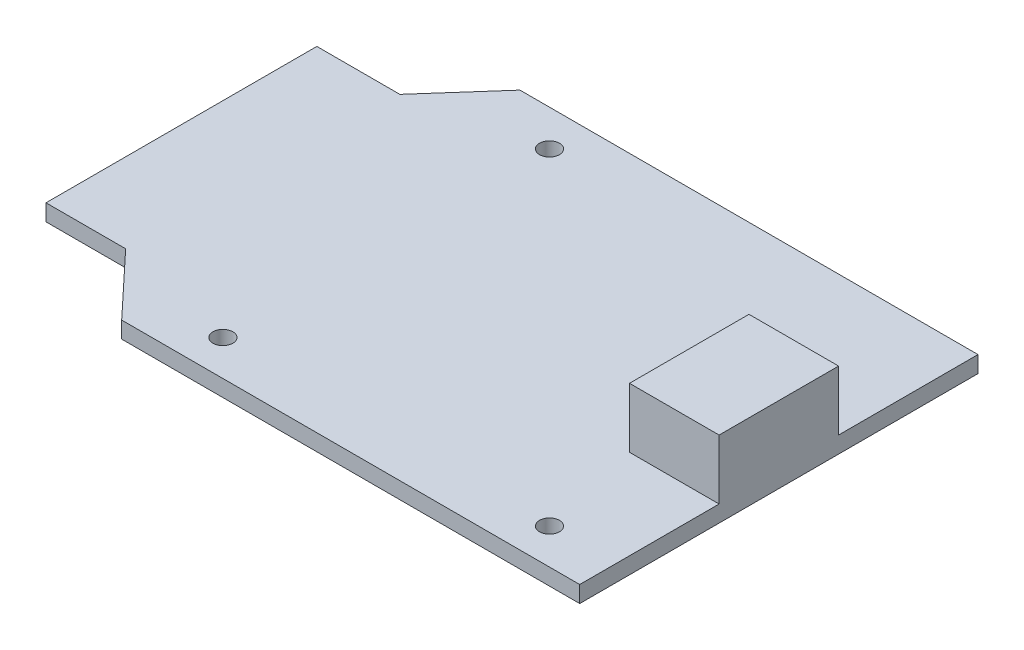
ISO-10303-21;
HEADER;
FILE_DESCRIPTION(('STEP AP214'),'2;1');
FILE_NAME('part.step','',(''),(''),'','','');
FILE_SCHEMA(('AUTOMOTIVE_DESIGN { 1 0 10303 214 1 1 1 1 }'));
ENDSEC;
DATA;
#1=APPLICATION_CONTEXT('core data for automotive mechanical design processes');
#2=APPLICATION_PROTOCOL_DEFINITION('international standard','automotive_design',2000,#1);
#3=PRODUCT_CONTEXT('',#1,'mechanical');
#4=PRODUCT('Part','Part','',(#3));
#5=PRODUCT_RELATED_PRODUCT_CATEGORY('part','',(#4));
#6=PRODUCT_DEFINITION_FORMATION('','',#4);
#7=PRODUCT_DEFINITION_CONTEXT('part definition',#1,'design');
#8=PRODUCT_DEFINITION('design','',#6,#7);
#9=PRODUCT_DEFINITION_SHAPE('','',#8);
#10=(LENGTH_UNIT() NAMED_UNIT(*) SI_UNIT(.MILLI.,.METRE.));
#11=(NAMED_UNIT(*) PLANE_ANGLE_UNIT() SI_UNIT($,.RADIAN.));
#12=(NAMED_UNIT(*) SI_UNIT($,.STERADIAN.) SOLID_ANGLE_UNIT());
#13=UNCERTAINTY_MEASURE_WITH_UNIT(LENGTH_MEASURE(1.E-05),#10,'distance_accuracy_value','');
#14=(GEOMETRIC_REPRESENTATION_CONTEXT(3) GLOBAL_UNCERTAINTY_ASSIGNED_CONTEXT((#13)) GLOBAL_UNIT_ASSIGNED_CONTEXT((#10,
#11,#12)) REPRESENTATION_CONTEXT('',''));
#15=CARTESIAN_POINT('',(0.,0.,0.));
#16=DIRECTION('',(0.,0.,1.));
#17=DIRECTION('',(1.,0.,0.));
#18=AXIS2_PLACEMENT_3D('',#15,#16,#17);
#19=CARTESIAN_POINT('',(0.,0.83,0.));
#20=DIRECTION('',(0.,-1.,0.));
#21=DIRECTION('',(0.,0.,-1.));
#22=AXIS2_PLACEMENT_3D('',#19,#20,#21);
#23=PLANE('',#22);
#24=CARTESIAN_POINT('',(19.7,0.83,18.2172922770292));
#25=DIRECTION('',(0.,1.,0.));
#26=DIRECTION('',(0.,0.,1.));
#27=AXIS2_PLACEMENT_3D('',#24,#25,#26);
#28=CIRCLE('',#27,0.499999999999999);
#29=CARTESIAN_POINT('',(19.7,0.83,18.7172922770292));
#30=VERTEX_POINT('',#29);
#31=EDGE_CURVE('E151',#30,#30,#28,.T.);
#32=ORIENTED_EDGE('',*,*,#31,.F.);
#33=EDGE_LOOP('',(#32));
#34=FACE_BOUND('',#33,.T.);
#35=CARTESIAN_POINT('',(3.3,0.83,18.2172922770292));
#36=DIRECTION('',(0.,1.,0.));
#37=DIRECTION('',(0.,0.,1.));
#38=AXIS2_PLACEMENT_3D('',#35,#36,#37);
#39=CIRCLE('',#38,0.499999999999999);
#40=CARTESIAN_POINT('',(3.3,0.83,18.7172922770292));
#41=VERTEX_POINT('',#40);
#42=EDGE_CURVE('E179',#41,#41,#39,.T.);
#43=ORIENTED_EDGE('',*,*,#42,.F.);
#44=EDGE_LOOP('',(#43));
#45=FACE_BOUND('',#44,.T.);
#46=CARTESIAN_POINT('',(3.3,0.83,1.81729227702918));
#47=DIRECTION('',(0.,1.,0.));
#48=DIRECTION('',(0.,0.,1.));
#49=AXIS2_PLACEMENT_3D('',#46,#47,#48);
#50=CIRCLE('',#49,0.499999999999999);
#51=CARTESIAN_POINT('',(3.3,0.83,2.31729227702917));
#52=VERTEX_POINT('',#51);
#53=EDGE_CURVE('E173',#52,#52,#50,.T.);
#54=ORIENTED_EDGE('',*,*,#53,.F.);
#55=EDGE_LOOP('',(#54));
#56=FACE_BOUND('',#55,.T.);
#57=DIRECTION('',(1.,0.,0.));
#58=VECTOR('',#57,1.);
#59=CARTESIAN_POINT('',(23.,0.83,13.));
#60=LINE('',#59,#58);
#61=CARTESIAN_POINT('',(18.5,0.83,13.));
#62=VERTEX_POINT('',#61);
#63=CARTESIAN_POINT('',(23.,0.83,13.));
#64=VERTEX_POINT('',#63);
#65=EDGE_CURVE('E52',#62,#64,#60,.T.);
#66=ORIENTED_EDGE('',*,*,#65,.F.);
#67=DIRECTION('',(0.,0.,1.));
#68=VECTOR('',#67,1.);
#69=CARTESIAN_POINT('',(18.5,0.83,7.));
#70=LINE('',#69,#68);
#71=CARTESIAN_POINT('',(18.5,0.83,7.));
#72=VERTEX_POINT('',#71);
#73=EDGE_CURVE('E162',#72,#62,#70,.T.);
#74=ORIENTED_EDGE('',*,*,#73,.F.);
#75=DIRECTION('',(-1.,0.,0.));
#76=VECTOR('',#75,1.);
#77=CARTESIAN_POINT('',(23.,0.83,7.));
#78=LINE('',#77,#76);
#79=CARTESIAN_POINT('',(23.,0.83,7.));
#80=VERTEX_POINT('',#79);
#81=EDGE_CURVE('E58',#80,#72,#78,.T.);
#82=ORIENTED_EDGE('',*,*,#81,.F.);
#83=DIRECTION('',(0.,0.,-1.));
#84=VECTOR('',#83,1.);
#85=CARTESIAN_POINT('',(23.,0.83,0.));
#86=LINE('',#85,#84);
#87=CARTESIAN_POINT('',(23.,0.83,0.));
#88=VERTEX_POINT('',#87);
#89=EDGE_CURVE('E147',#80,#88,#86,.T.);
#90=ORIENTED_EDGE('',*,*,#89,.T.);
#91=DIRECTION('',(-1.,0.,0.));
#92=VECTOR('',#91,1.);
#93=CARTESIAN_POINT('',(0.,0.83,0.));
#94=LINE('',#93,#92);
#95=CARTESIAN_POINT('',(0.,0.83,0.));
#96=VERTEX_POINT('',#95);
#97=EDGE_CURVE('E185',#88,#96,#94,.T.);
#98=ORIENTED_EDGE('',*,*,#97,.T.);
#99=DIRECTION('',(-0.662472858366407,0.,0.749085917587457));
#100=VECTOR('',#99,1.);
#101=CARTESIAN_POINT('',(0.,0.83,0.));
#102=LINE('',#101,#100);
#103=CARTESIAN_POINT('',(-2.83,0.83,3.2));
#104=VERTEX_POINT('',#103);
#105=EDGE_CURVE('E188',#96,#104,#102,.T.);
#106=ORIENTED_EDGE('',*,*,#105,.T.);
#107=DIRECTION('',(-1.,0.,0.));
#108=VECTOR('',#107,1.);
#109=CARTESIAN_POINT('',(-7.,0.83,3.2));
#110=LINE('',#109,#108);
#111=CARTESIAN_POINT('',(-7.,0.83,3.2));
#112=VERTEX_POINT('',#111);
#113=EDGE_CURVE('E191',#104,#112,#110,.T.);
#114=ORIENTED_EDGE('',*,*,#113,.T.);
#115=DIRECTION('',(0.,0.,1.));
#116=VECTOR('',#115,1.);
#117=CARTESIAN_POINT('',(-7.,0.83,3.2));
#118=LINE('',#117,#116);
#119=CARTESIAN_POINT('',(-7.,0.83,16.8));
#120=VERTEX_POINT('',#119);
#121=EDGE_CURVE('E193',#112,#120,#118,.T.);
#122=ORIENTED_EDGE('',*,*,#121,.T.);
#123=DIRECTION('',(1.,0.,0.));
#124=VECTOR('',#123,1.);
#125=CARTESIAN_POINT('',(-7.,0.83,16.8));
#126=LINE('',#125,#124);
#127=CARTESIAN_POINT('',(-3.00000000000001,0.83,16.8));
#128=VERTEX_POINT('',#127);
#129=EDGE_CURVE('E195',#120,#128,#126,.T.);
#130=ORIENTED_EDGE('',*,*,#129,.T.);
#131=DIRECTION('',(0.68394112888133,0.,0.729537204140085));
#132=VECTOR('',#131,1.);
#133=CARTESIAN_POINT('',(0.,0.83,20.));
#134=LINE('',#133,#132);
#135=CARTESIAN_POINT('',(0.,0.83,20.));
#136=VERTEX_POINT('',#135);
#137=EDGE_CURVE('E197',#128,#136,#134,.T.);
#138=ORIENTED_EDGE('',*,*,#137,.T.);
#139=DIRECTION('',(1.,0.,0.));
#140=VECTOR('',#139,1.);
#141=CARTESIAN_POINT('',(0.,0.83,20.));
#142=LINE('',#141,#140);
#143=CARTESIAN_POINT('',(23.,0.83,20.));
#144=VERTEX_POINT('',#143);
#145=EDGE_CURVE('E199',#136,#144,#142,.T.);
#146=ORIENTED_EDGE('',*,*,#145,.T.);
#147=EDGE_CURVE('E207',#144,#64,#86,.T.);
#148=ORIENTED_EDGE('',*,*,#147,.T.);
#149=EDGE_LOOP('',(#66,#74,#82,#90,#98,#106,#114,#122,#130,#138,#146,#148));
#150=FACE_BOUND('',#149,.T.);
#151=ADVANCED_FACE('F35',(#34,#45,#56,#150),#23,.F.);
#152=CARTESIAN_POINT('',(0.,0.,0.));
#153=DIRECTION('',(0.,-1.,0.));
#154=DIRECTION('',(0.,0.,-1.));
#155=AXIS2_PLACEMENT_3D('',#152,#153,#154);
#156=PLANE('',#155);
#157=CARTESIAN_POINT('',(3.3,0.,1.81729227702918));
#158=DIRECTION('',(0.,1.,0.));
#159=DIRECTION('',(0.,0.,1.));
#160=AXIS2_PLACEMENT_3D('',#157,#158,#159);
#161=CIRCLE('',#160,0.499999999999999);
#162=CARTESIAN_POINT('',(3.3,0.,2.31729227702917));
#163=VERTEX_POINT('',#162);
#164=EDGE_CURVE('E171',#163,#163,#161,.T.);
#165=ORIENTED_EDGE('',*,*,#164,.T.);
#166=EDGE_LOOP('',(#165));
#167=FACE_BOUND('',#166,.T.);
#168=DIRECTION('',(-1.,0.,0.));
#169=VECTOR('',#168,1.);
#170=CARTESIAN_POINT('',(0.,0.,0.));
#171=LINE('',#170,#169);
#172=CARTESIAN_POINT('',(23.,0.,0.));
#173=VERTEX_POINT('',#172);
#174=CARTESIAN_POINT('',(0.,0.,0.));
#175=VERTEX_POINT('',#174);
#176=EDGE_CURVE('E182',#173,#175,#171,.T.);
#177=ORIENTED_EDGE('',*,*,#176,.F.);
#178=DIRECTION('',(0.,0.,-1.));
#179=VECTOR('',#178,1.);
#180=CARTESIAN_POINT('',(23.,0.,0.));
#181=LINE('',#180,#179);
#182=CARTESIAN_POINT('',(23.,0.,20.));
#183=VERTEX_POINT('',#182);
#184=EDGE_CURVE('E189',#183,#173,#181,.T.);
#185=ORIENTED_EDGE('',*,*,#184,.F.);
#186=DIRECTION('',(1.,0.,0.));
#187=VECTOR('',#186,1.);
#188=CARTESIAN_POINT('',(0.,0.,20.));
#189=LINE('',#188,#187);
#190=CARTESIAN_POINT('',(0.,0.,20.));
#191=VERTEX_POINT('',#190);
#192=EDGE_CURVE('E230',#191,#183,#189,.T.);
#193=ORIENTED_EDGE('',*,*,#192,.F.);
#194=DIRECTION('',(0.68394112888133,0.,0.729537204140085));
#195=VECTOR('',#194,1.);
#196=CARTESIAN_POINT('',(0.,0.,20.));
#197=LINE('',#196,#195);
#198=CARTESIAN_POINT('',(-3.00000000000001,0.,16.8));
#199=VERTEX_POINT('',#198);
#200=EDGE_CURVE('E232',#199,#191,#197,.T.);
#201=ORIENTED_EDGE('',*,*,#200,.F.);
#202=DIRECTION('',(1.,0.,0.));
#203=VECTOR('',#202,1.);
#204=CARTESIAN_POINT('',(-7.,0.,16.8));
#205=LINE('',#204,#203);
#206=CARTESIAN_POINT('',(-7.,0.,16.8));
#207=VERTEX_POINT('',#206);
#208=EDGE_CURVE('E234',#207,#199,#205,.T.);
#209=ORIENTED_EDGE('',*,*,#208,.F.);
#210=DIRECTION('',(0.,0.,1.));
#211=VECTOR('',#210,1.);
#212=CARTESIAN_POINT('',(-7.,0.,3.2));
#213=LINE('',#212,#211);
#214=CARTESIAN_POINT('',(-7.,0.,3.2));
#215=VERTEX_POINT('',#214);
#216=EDGE_CURVE('E236',#215,#207,#213,.T.);
#217=ORIENTED_EDGE('',*,*,#216,.F.);
#218=DIRECTION('',(-1.,0.,0.));
#219=VECTOR('',#218,1.);
#220=CARTESIAN_POINT('',(-7.,0.,3.2));
#221=LINE('',#220,#219);
#222=CARTESIAN_POINT('',(-2.83,0.,3.2));
#223=VERTEX_POINT('',#222);
#224=EDGE_CURVE('E238',#223,#215,#221,.T.);
#225=ORIENTED_EDGE('',*,*,#224,.F.);
#226=DIRECTION('',(-0.662472858366407,0.,0.749085917587457));
#227=VECTOR('',#226,1.);
#228=CARTESIAN_POINT('',(0.,0.,0.));
#229=LINE('',#228,#227);
#230=EDGE_CURVE('E239',#175,#223,#229,.T.);
#231=ORIENTED_EDGE('',*,*,#230,.F.);
#232=EDGE_LOOP('',(#177,#185,#193,#201,#209,#217,#225,#231));
#233=FACE_BOUND('',#232,.T.);
#234=CARTESIAN_POINT('',(3.3,0.,18.2172922770292));
#235=DIRECTION('',(0.,1.,0.));
#236=DIRECTION('',(0.,0.,1.));
#237=AXIS2_PLACEMENT_3D('',#234,#235,#236);
#238=CIRCLE('',#237,0.499999999999999);
#239=CARTESIAN_POINT('',(3.3,0.,18.7172922770292));
#240=VERTEX_POINT('',#239);
#241=EDGE_CURVE('E176',#240,#240,#238,.T.);
#242=ORIENTED_EDGE('',*,*,#241,.T.);
#243=EDGE_LOOP('',(#242));
#244=FACE_BOUND('',#243,.T.);
#245=CARTESIAN_POINT('',(19.7,0.,18.2172922770292));
#246=DIRECTION('',(0.,1.,0.));
#247=DIRECTION('',(0.,0.,1.));
#248=AXIS2_PLACEMENT_3D('',#245,#246,#247);
#249=CIRCLE('',#248,0.499999999999999);
#250=CARTESIAN_POINT('',(19.7,0.,18.7172922770292));
#251=VERTEX_POINT('',#250);
#252=EDGE_CURVE('E148',#251,#251,#249,.T.);
#253=ORIENTED_EDGE('',*,*,#252,.T.);
#254=EDGE_LOOP('',(#253));
#255=FACE_BOUND('',#254,.T.);
#256=ADVANCED_FACE('F249',(#167,#233,#244,#255),#156,.T.);
#257=CARTESIAN_POINT('',(0.,0.83,0.));
#258=DIRECTION('',(0.,0.,1.));
#259=DIRECTION('',(1.,0.,0.));
#260=AXIS2_PLACEMENT_3D('',#257,#258,#259);
#261=PLANE('',#260);
#262=ORIENTED_EDGE('',*,*,#176,.T.);
#263=DIRECTION('',(0.,-1.,0.));
#264=VECTOR('',#263,1.);
#265=CARTESIAN_POINT('',(0.,0.83,0.));
#266=LINE('',#265,#264);
#267=EDGE_CURVE('E11',#96,#175,#266,.T.);
#268=ORIENTED_EDGE('',*,*,#267,.F.);
#269=ORIENTED_EDGE('',*,*,#97,.F.);
#270=DIRECTION('',(0.,-1.,0.));
#271=VECTOR('',#270,1.);
#272=CARTESIAN_POINT('',(23.,0.83,0.));
#273=LINE('',#272,#271);
#274=EDGE_CURVE('E208',#88,#173,#273,.T.);
#275=ORIENTED_EDGE('',*,*,#274,.T.);
#276=EDGE_LOOP('',(#262,#268,#269,#275));
#277=FACE_BOUND('',#276,.T.);
#278=ADVANCED_FACE('F37',(#277),#261,.F.);
#279=CARTESIAN_POINT('',(0.,0.83,0.));
#280=DIRECTION('',(0.749085917587457,0.,0.662472858366407));
#281=DIRECTION('',(0.662472858366407,0.,-0.749085917587457));
#282=AXIS2_PLACEMENT_3D('',#279,#280,#281);
#283=PLANE('',#282);
#284=ORIENTED_EDGE('',*,*,#230,.T.);
#285=DIRECTION('',(0.,-1.,0.));
#286=VECTOR('',#285,1.);
#287=CARTESIAN_POINT('',(-2.83,0.83,3.2));
#288=LINE('',#287,#286);
#289=EDGE_CURVE('E44',#104,#223,#288,.T.);
#290=ORIENTED_EDGE('',*,*,#289,.F.);
#291=ORIENTED_EDGE('',*,*,#105,.F.);
#292=ORIENTED_EDGE('',*,*,#267,.T.);
#293=EDGE_LOOP('',(#284,#290,#291,#292));
#294=FACE_BOUND('',#293,.T.);
#295=ADVANCED_FACE('F254',(#294),#283,.F.);
#296=CARTESIAN_POINT('',(-7.,0.83,3.2));
#297=DIRECTION('',(0.,0.,1.));
#298=DIRECTION('',(1.,0.,0.));
#299=AXIS2_PLACEMENT_3D('',#296,#297,#298);
#300=PLANE('',#299);
#301=ORIENTED_EDGE('',*,*,#224,.T.);
#302=DIRECTION('',(0.,-1.,0.));
#303=VECTOR('',#302,1.);
#304=CARTESIAN_POINT('',(-7.,0.83,3.2));
#305=LINE('',#304,#303);
#306=EDGE_CURVE('E212',#112,#215,#305,.T.);
#307=ORIENTED_EDGE('',*,*,#306,.F.);
#308=ORIENTED_EDGE('',*,*,#113,.F.);
#309=ORIENTED_EDGE('',*,*,#289,.T.);
#310=EDGE_LOOP('',(#301,#307,#308,#309));
#311=FACE_BOUND('',#310,.T.);
#312=ADVANCED_FACE('F277',(#311),#300,.F.);
#313=CARTESIAN_POINT('',(-7.,0.83,3.2));
#314=DIRECTION('',(1.,0.,0.));
#315=DIRECTION('',(0.,0.,-1.));
#316=AXIS2_PLACEMENT_3D('',#313,#314,#315);
#317=PLANE('',#316);
#318=ORIENTED_EDGE('',*,*,#216,.T.);
#319=DIRECTION('',(0.,-1.,0.));
#320=VECTOR('',#319,1.);
#321=CARTESIAN_POINT('',(-7.,0.83,16.8));
#322=LINE('',#321,#320);
#323=EDGE_CURVE('E215',#120,#207,#322,.T.);
#324=ORIENTED_EDGE('',*,*,#323,.F.);
#325=ORIENTED_EDGE('',*,*,#121,.F.);
#326=ORIENTED_EDGE('',*,*,#306,.T.);
#327=EDGE_LOOP('',(#318,#324,#325,#326));
#328=FACE_BOUND('',#327,.T.);
#329=ADVANCED_FACE('F274',(#328),#317,.F.);
#330=CARTESIAN_POINT('',(-7.,0.83,16.8));
#331=DIRECTION('',(0.,0.,-1.));
#332=DIRECTION('',(-1.,0.,0.));
#333=AXIS2_PLACEMENT_3D('',#330,#331,#332);
#334=PLANE('',#333);
#335=ORIENTED_EDGE('',*,*,#208,.T.);
#336=DIRECTION('',(0.,-1.,0.));
#337=VECTOR('',#336,1.);
#338=CARTESIAN_POINT('',(-3.00000000000001,0.83,16.8));
#339=LINE('',#338,#337);
#340=EDGE_CURVE('E218',#128,#199,#339,.T.);
#341=ORIENTED_EDGE('',*,*,#340,.F.);
#342=ORIENTED_EDGE('',*,*,#129,.F.);
#343=ORIENTED_EDGE('',*,*,#323,.T.);
#344=EDGE_LOOP('',(#335,#341,#342,#343));
#345=FACE_BOUND('',#344,.T.);
#346=ADVANCED_FACE('F270',(#345),#334,.F.);
#347=CARTESIAN_POINT('',(0.,0.83,20.));
#348=DIRECTION('',(0.729537204140085,0.,-0.68394112888133));
#349=DIRECTION('',(-0.68394112888133,0.,-0.729537204140085));
#350=AXIS2_PLACEMENT_3D('',#347,#348,#349);
#351=PLANE('',#350);
#352=ORIENTED_EDGE('',*,*,#200,.T.);
#353=DIRECTION('',(0.,-1.,0.));
#354=VECTOR('',#353,1.);
#355=CARTESIAN_POINT('',(0.,0.83,20.));
#356=LINE('',#355,#354);
#357=EDGE_CURVE('E221',#136,#191,#356,.T.);
#358=ORIENTED_EDGE('',*,*,#357,.F.);
#359=ORIENTED_EDGE('',*,*,#137,.F.);
#360=ORIENTED_EDGE('',*,*,#340,.T.);
#361=EDGE_LOOP('',(#352,#358,#359,#360));
#362=FACE_BOUND('',#361,.T.);
#363=ADVANCED_FACE('F265',(#362),#351,.F.);
#364=CARTESIAN_POINT('',(0.,0.83,20.));
#365=DIRECTION('',(0.,0.,-1.));
#366=DIRECTION('',(-1.,0.,0.));
#367=AXIS2_PLACEMENT_3D('',#364,#365,#366);
#368=PLANE('',#367);
#369=ORIENTED_EDGE('',*,*,#192,.T.);
#370=DIRECTION('',(0.,-1.,0.));
#371=VECTOR('',#370,1.);
#372=CARTESIAN_POINT('',(23.,0.83,20.));
#373=LINE('',#372,#371);
#374=EDGE_CURVE('E224',#144,#183,#373,.T.);
#375=ORIENTED_EDGE('',*,*,#374,.F.);
#376=ORIENTED_EDGE('',*,*,#145,.F.);
#377=ORIENTED_EDGE('',*,*,#357,.T.);
#378=EDGE_LOOP('',(#369,#375,#376,#377));
#379=FACE_BOUND('',#378,.T.);
#380=ADVANCED_FACE('F260',(#379),#368,.F.);
#381=CARTESIAN_POINT('',(23.,0.83,0.));
#382=DIRECTION('',(-1.,0.,0.));
#383=DIRECTION('',(0.,0.,1.));
#384=AXIS2_PLACEMENT_3D('',#381,#382,#383);
#385=PLANE('',#384);
#386=ORIENTED_EDGE('',*,*,#184,.T.);
#387=ORIENTED_EDGE('',*,*,#274,.F.);
#388=ORIENTED_EDGE('',*,*,#89,.F.);
#389=DIRECTION('',(0.,-1.,0.));
#390=VECTOR('',#389,1.);
#391=CARTESIAN_POINT('',(23.,3.83,7.));
#392=LINE('',#391,#390);
#393=CARTESIAN_POINT('',(23.,3.83,7.));
#394=VERTEX_POINT('',#393);
#395=EDGE_CURVE('E129',#394,#80,#392,.T.);
#396=ORIENTED_EDGE('',*,*,#395,.F.);
#397=DIRECTION('',(0.,0.,-1.));
#398=VECTOR('',#397,1.);
#399=CARTESIAN_POINT('',(23.,3.83,7.));
#400=LINE('',#399,#398);
#401=CARTESIAN_POINT('',(23.,3.83,13.));
#402=VERTEX_POINT('',#401);
#403=EDGE_CURVE('E135',#402,#394,#400,.T.);
#404=ORIENTED_EDGE('',*,*,#403,.F.);
#405=DIRECTION('',(0.,-1.,0.));
#406=VECTOR('',#405,1.);
#407=CARTESIAN_POINT('',(23.,3.83,13.));
#408=LINE('',#407,#406);
#409=EDGE_CURVE('E163',#402,#64,#408,.T.);
#410=ORIENTED_EDGE('',*,*,#409,.T.);
#411=ORIENTED_EDGE('',*,*,#147,.F.);
#412=ORIENTED_EDGE('',*,*,#374,.T.);
#413=EDGE_LOOP('',(#386,#387,#388,#396,#404,#410,#411,#412));
#414=FACE_BOUND('',#413,.T.);
#415=ADVANCED_FACE('F145',(#414),#385,.F.);
#416=CARTESIAN_POINT('',(3.3,0.83,18.2172922770292));
#417=DIRECTION('',(0.,-1.,0.));
#418=DIRECTION('',(0.,0.,-1.));
#419=AXIS2_PLACEMENT_3D('',#416,#417,#418);
#420=CYLINDRICAL_SURFACE('',#419,0.499999999999999);
#421=ORIENTED_EDGE('',*,*,#42,.T.);
#422=EDGE_LOOP('',(#421));
#423=FACE_BOUND('',#422,.T.);
#424=ORIENTED_EDGE('',*,*,#241,.F.);
#425=EDGE_LOOP('',(#424));
#426=FACE_BOUND('',#425,.T.);
#427=ADVANCED_FACE('F304',(#423,#426),#420,.F.);
#428=CARTESIAN_POINT('',(3.3,0.83,1.81729227702918));
#429=DIRECTION('',(0.,-1.,0.));
#430=DIRECTION('',(0.,0.,-1.));
#431=AXIS2_PLACEMENT_3D('',#428,#429,#430);
#432=CYLINDRICAL_SURFACE('',#431,0.499999999999999);
#433=ORIENTED_EDGE('',*,*,#53,.T.);
#434=EDGE_LOOP('',(#433));
#435=FACE_BOUND('',#434,.T.);
#436=ORIENTED_EDGE('',*,*,#164,.F.);
#437=EDGE_LOOP('',(#436));
#438=FACE_BOUND('',#437,.T.);
#439=ADVANCED_FACE('F378',(#435,#438),#432,.F.);
#440=CARTESIAN_POINT('',(19.7,0.83,18.2172922770292));
#441=DIRECTION('',(0.,-1.,0.));
#442=DIRECTION('',(0.,0.,-1.));
#443=AXIS2_PLACEMENT_3D('',#440,#441,#442);
#444=CYLINDRICAL_SURFACE('',#443,0.499999999999999);
#445=ORIENTED_EDGE('',*,*,#31,.T.);
#446=EDGE_LOOP('',(#445));
#447=FACE_BOUND('',#446,.T.);
#448=ORIENTED_EDGE('',*,*,#252,.F.);
#449=EDGE_LOOP('',(#448));
#450=FACE_BOUND('',#449,.T.);
#451=ADVANCED_FACE('F291',(#447,#450),#444,.F.);
#452=CARTESIAN_POINT('',(23.,3.83,7.));
#453=DIRECTION('',(0.,0.,1.));
#454=DIRECTION('',(1.,0.,0.));
#455=AXIS2_PLACEMENT_3D('',#452,#453,#454);
#456=PLANE('',#455);
#457=ORIENTED_EDGE('',*,*,#81,.T.);
#458=DIRECTION('',(0.,-1.,0.));
#459=VECTOR('',#458,1.);
#460=CARTESIAN_POINT('',(18.5,3.83,7.));
#461=LINE('',#460,#459);
#462=CARTESIAN_POINT('',(18.5,3.83,7.));
#463=VERTEX_POINT('',#462);
#464=EDGE_CURVE('E131',#463,#72,#461,.T.);
#465=ORIENTED_EDGE('',*,*,#464,.F.);
#466=DIRECTION('',(-1.,0.,0.));
#467=VECTOR('',#466,1.);
#468=CARTESIAN_POINT('',(23.,3.83,7.));
#469=LINE('',#468,#467);
#470=EDGE_CURVE('E125',#394,#463,#469,.T.);
#471=ORIENTED_EDGE('',*,*,#470,.F.);
#472=ORIENTED_EDGE('',*,*,#395,.T.);
#473=EDGE_LOOP('',(#457,#465,#471,#472));
#474=FACE_BOUND('',#473,.T.);
#475=ADVANCED_FACE('F127',(#474),#456,.F.);
#476=CARTESIAN_POINT('',(18.5,3.83,7.));
#477=DIRECTION('',(1.,0.,0.));
#478=DIRECTION('',(0.,0.,-1.));
#479=AXIS2_PLACEMENT_3D('',#476,#477,#478);
#480=PLANE('',#479);
#481=ORIENTED_EDGE('',*,*,#73,.T.);
#482=DIRECTION('',(0.,-1.,0.));
#483=VECTOR('',#482,1.);
#484=CARTESIAN_POINT('',(18.5,3.83,13.));
#485=LINE('',#484,#483);
#486=CARTESIAN_POINT('',(18.5,3.83,13.));
#487=VERTEX_POINT('',#486);
#488=EDGE_CURVE('E153',#487,#62,#485,.T.);
#489=ORIENTED_EDGE('',*,*,#488,.F.);
#490=DIRECTION('',(0.,0.,1.));
#491=VECTOR('',#490,1.);
#492=CARTESIAN_POINT('',(18.5,3.83,7.));
#493=LINE('',#492,#491);
#494=EDGE_CURVE('E134',#463,#487,#493,.T.);
#495=ORIENTED_EDGE('',*,*,#494,.F.);
#496=ORIENTED_EDGE('',*,*,#464,.T.);
#497=EDGE_LOOP('',(#481,#489,#495,#496));
#498=FACE_BOUND('',#497,.T.);
#499=ADVANCED_FACE('F283',(#498),#480,.F.);
#500=CARTESIAN_POINT('',(23.,3.83,13.));
#501=DIRECTION('',(0.,0.,-1.));
#502=DIRECTION('',(-1.,0.,0.));
#503=AXIS2_PLACEMENT_3D('',#500,#501,#502);
#504=PLANE('',#503);
#505=ORIENTED_EDGE('',*,*,#65,.T.);
#506=ORIENTED_EDGE('',*,*,#409,.F.);
#507=DIRECTION('',(1.,0.,0.));
#508=VECTOR('',#507,1.);
#509=CARTESIAN_POINT('',(23.,3.83,13.));
#510=LINE('',#509,#508);
#511=EDGE_CURVE('E140',#487,#402,#510,.T.);
#512=ORIENTED_EDGE('',*,*,#511,.F.);
#513=ORIENTED_EDGE('',*,*,#488,.T.);
#514=EDGE_LOOP('',(#505,#506,#512,#513));
#515=FACE_BOUND('',#514,.T.);
#516=ADVANCED_FACE('F279',(#515),#504,.F.);
#517=CARTESIAN_POINT('',(0.,3.83,0.));
#518=DIRECTION('',(0.,-1.,0.));
#519=DIRECTION('',(0.,0.,-1.));
#520=AXIS2_PLACEMENT_3D('',#517,#518,#519);
#521=PLANE('',#520);
#522=ORIENTED_EDGE('',*,*,#403,.T.);
#523=ORIENTED_EDGE('',*,*,#470,.T.);
#524=ORIENTED_EDGE('',*,*,#494,.T.);
#525=ORIENTED_EDGE('',*,*,#511,.T.);
#526=EDGE_LOOP('',(#522,#523,#524,#525));
#527=FACE_BOUND('',#526,.T.);
#528=ADVANCED_FACE('F138',(#527),#521,.F.);
#529=CLOSED_SHELL('',(#151,#256,#278,#295,#312,#329,#346,#363,#380,#415,#427,#439,#451,#475,
#499,#516,#528));
#530=MANIFOLD_SOLID_BREP('B2',#529);
#531=ADVANCED_BREP_SHAPE_REPRESENTATION('',(#18,#530),#14);
#532=SHAPE_DEFINITION_REPRESENTATION(#9,#531);
ENDSEC;
END-ISO-10303-21;
